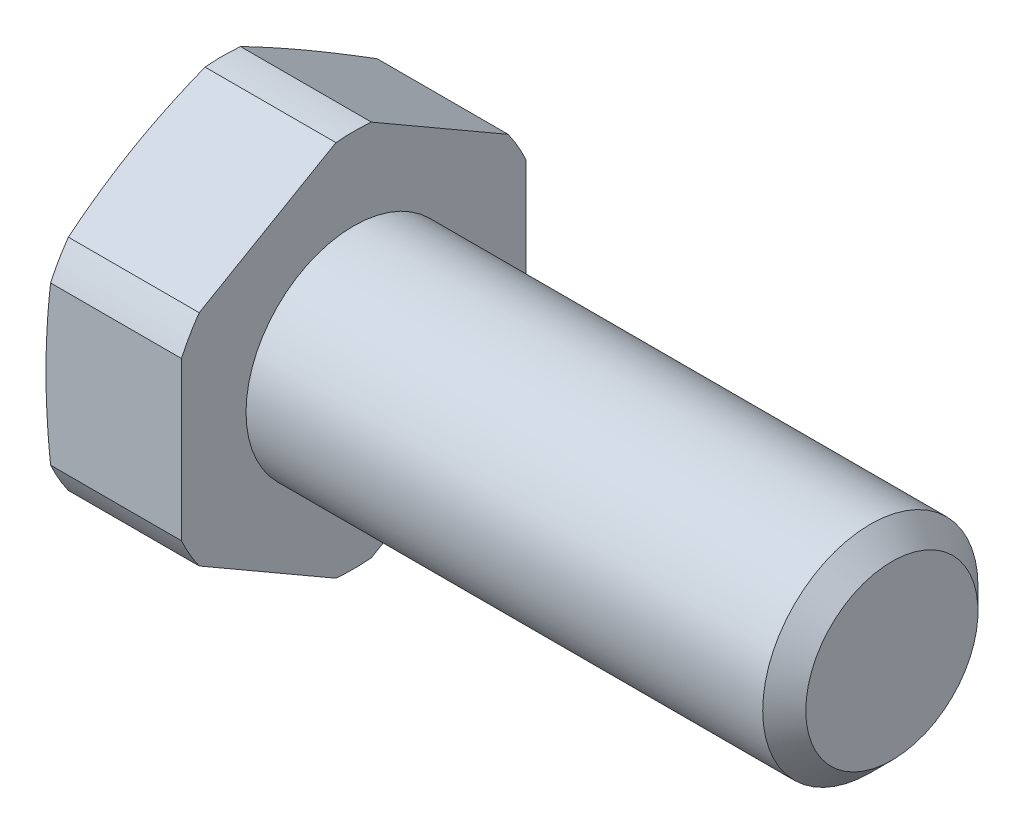
ISO-10303-21;
HEADER;
FILE_DESCRIPTION(('STEP AP214'),'2;1');
FILE_NAME('part.step','',(''),(''),'','','');
FILE_SCHEMA(('AUTOMOTIVE_DESIGN { 1 0 10303 214 1 1 1 1 }'));
ENDSEC;
DATA;
#1=APPLICATION_CONTEXT('core data for automotive mechanical design processes');
#2=APPLICATION_PROTOCOL_DEFINITION('international standard','automotive_design',2000,#1);
#3=PRODUCT_CONTEXT('',#1,'mechanical');
#4=PRODUCT('Part','Part','',(#3));
#5=PRODUCT_RELATED_PRODUCT_CATEGORY('part','',(#4));
#6=PRODUCT_DEFINITION_FORMATION('','',#4);
#7=PRODUCT_DEFINITION_CONTEXT('part definition',#1,'design');
#8=PRODUCT_DEFINITION('design','',#6,#7);
#9=PRODUCT_DEFINITION_SHAPE('','',#8);
#10=(LENGTH_UNIT() NAMED_UNIT(*) SI_UNIT(.MILLI.,.METRE.));
#11=(NAMED_UNIT(*) PLANE_ANGLE_UNIT() SI_UNIT($,.RADIAN.));
#12=(NAMED_UNIT(*) SI_UNIT($,.STERADIAN.) SOLID_ANGLE_UNIT());
#13=UNCERTAINTY_MEASURE_WITH_UNIT(LENGTH_MEASURE(1.E-05),#10,'distance_accuracy_value','');
#14=(GEOMETRIC_REPRESENTATION_CONTEXT(3) GLOBAL_UNCERTAINTY_ASSIGNED_CONTEXT((#13)) GLOBAL_UNIT_ASSIGNED_CONTEXT((#10,
#11,#12)) REPRESENTATION_CONTEXT('',''));
#15=CARTESIAN_POINT('',(0.,0.,0.));
#16=DIRECTION('',(0.,0.,1.));
#17=DIRECTION('',(1.,0.,0.));
#18=AXIS2_PLACEMENT_3D('',#15,#16,#17);
#19=CARTESIAN_POINT('',(-6.0784609690826,0.,0.));
#20=DIRECTION('',(1.,0.,0.));
#21=DIRECTION('',(0.,0.,-1.));
#22=AXIS2_PLACEMENT_3D('',#19,#20,#21);
#23=CONICAL_SURFACE('',#22,8.8,1.30899693899574);
#24=CARTESIAN_POINT('',(-6.39999999999996,0.,0.));
#25=DIRECTION('',(-1.,0.,0.));
#26=DIRECTION('',(0.,0.,1.));
#27=AXIS2_PLACEMENT_3D('',#24,#25,#26);
#28=CIRCLE('',#27,7.6);
#29=CARTESIAN_POINT('',(-6.39999999999996,0.,7.6));
#30=VERTEX_POINT('',#29);
#31=EDGE_CURVE('E134',#30,#30,#28,.T.);
#32=ORIENTED_EDGE('',*,*,#31,.F.);
#33=EDGE_LOOP('',(#32));
#34=FACE_BOUND('',#33,.T.);
#35=CARTESIAN_POINT('',(-6.0782609690826,5.09427729284164,-7.17645290095384));
#36=CARTESIAN_POINT('',(-6.11233521411133,5.24673459580645,-6.91238910623386));
#37=CARTESIAN_POINT('',(-6.14290411475749,5.399399818097,-6.64796518467785));
#38=CARTESIAN_POINT('',(-6.19617899279855,5.70509856387139,-6.11847942518651));
#39=CARTESIAN_POINT('',(-6.2188835631996,5.85813214833189,-5.85341748163655));
#40=CARTESIAN_POINT('',(-6.25550198129953,6.16394133316771,-5.32374043607968));
#41=CARTESIAN_POINT('',(-6.26944564691263,6.31671602415169,-5.0591269091848));
#42=CARTESIAN_POINT('',(-6.28810442863028,6.62239489485478,-4.52967557432677));
#43=CARTESIAN_POINT('',(-6.29282032302751,6.77529906256514,-4.26483778716339));
#44=CARTESIAN_POINT('',(-6.29282032302751,7.08110739798587,-3.73516221283661));
#45=CARTESIAN_POINT('',(-6.28810442863028,7.23401156569624,-3.47032442567323));
#46=CARTESIAN_POINT('',(-6.26944564691263,7.53969043639933,-2.9408730908152));
#47=CARTESIAN_POINT('',(-6.25550198129953,7.6924651273833,-2.67625956392032));
#48=CARTESIAN_POINT('',(-6.2188835631996,7.99827431221913,-2.14658251836345));
#49=CARTESIAN_POINT('',(-6.19617899279855,8.15130789667962,-1.88152057481348));
#50=CARTESIAN_POINT('',(-6.14290411475749,8.45700664245402,-1.35203481532215));
#51=CARTESIAN_POINT('',(-6.11233521411133,8.60967186474456,-1.08761089376613));
#52=CARTESIAN_POINT('',(-6.0782609690826,8.76212916770938,-0.823547099046155));
#53=B_SPLINE_CURVE_WITH_KNOTS('',3,(#35,#36,#37,#38,#39,#40,#41,#42,#43,#44,#45,#46,#47,#48,#49,
#50,#51,#52),.UNSPECIFIED.,.F.,.F.,(4,2,2,2,2,2,2,2,4),(0.,0.920453521143197,1.8410716340946,
2.75853918572606,3.67592935257665,4.59331951942724,5.51078707105871,6.43140518401011,
7.3518587051533),.UNSPECIFIED.);
#54=CARTESIAN_POINT('',(-6.0784609690826,5.09517295229317,-7.17490157327751));
#55=VERTEX_POINT('',#54);
#56=CARTESIAN_POINT('',(-6.0784609690826,8.76123350825785,-0.825098426722484));
#57=VERTEX_POINT('',#56);
#58=EDGE_CURVE('E206',#55,#57,#53,.T.);
#59=ORIENTED_EDGE('',*,*,#58,.F.);
#60=CARTESIAN_POINT('',(-6.0784609690826,0.,0.));
#61=DIRECTION('',(-1.,0.,0.));
#62=DIRECTION('',(0.,0.,1.));
#63=AXIS2_PLACEMENT_3D('',#60,#61,#62);
#64=CIRCLE('',#63,8.8);
#65=CARTESIAN_POINT('',(-6.0784609690826,3.66606055596466,-8.));
#66=VERTEX_POINT('',#65);
#67=EDGE_CURVE('E289',#55,#66,#64,.T.);
#68=ORIENTED_EDGE('',*,*,#67,.T.);
#69=CARTESIAN_POINT('',(-4.52835059955403,-12.1952806222728,-8.));
#70=CARTESIAN_POINT('',(-4.60958470236088,-11.8326033333338,-8.));
#71=CARTESIAN_POINT('',(-4.68982141688114,-11.46969855698,-8.));
#72=CARTESIAN_POINT('',(-4.84776173324878,-10.7433223565958,-8.));
#73=CARTESIAN_POINT('',(-4.9254652249717,-10.3798509086489,-8.));
#74=CARTESIAN_POINT('',(-5.07786901492262,-9.65190100818122,-8.));
#75=CARTESIAN_POINT('',(-5.15256626382136,-9.28742191496337,-8.));
#76=CARTESIAN_POINT('',(-5.29814759532216,-8.55770340441388,-8.));
#77=CARTESIAN_POINT('',(-5.3690317103539,-8.19246399357599,-8.));
#78=CARTESIAN_POINT('',(-5.50553069511125,-7.46401807454707,-8.));
#79=CARTESIAN_POINT('',(-5.57118314360988,-7.10081864291515,-8.));
#80=CARTESIAN_POINT('',(-5.6967308114908,-6.37342780848811,-8.));
#81=CARTESIAN_POINT('',(-5.75662615817,-6.00923642780944,-8.));
#82=CARTESIAN_POINT('',(-5.86930616766461,-5.27979364181287,-8.));
#83=CARTESIAN_POINT('',(-5.92209174386663,-4.91454237882789,-8.));
#84=CARTESIAN_POINT('',(-6.0189925088353,-4.18287833840633,-8.));
#85=CARTESIAN_POINT('',(-6.06310769045196,-3.81646556001218,-8.));
#86=CARTESIAN_POINT('',(-6.14141359964569,-3.07835342212742,-8.));
#87=CARTESIAN_POINT('',(-6.17548585135962,-2.70664130390878,-8.));
#88=CARTESIAN_POINT('',(-6.23135223506376,-1.9622876095219,-8.));
#89=CARTESIAN_POINT('',(-6.25314664862051,-1.58964605486521,-8.));
#90=CARTESIAN_POINT('',(-6.28318597760241,-0.843973611050866,-8.));
#91=CARTESIAN_POINT('',(-6.29143697245586,-0.470942971834518,-8.));
#92=CARTESIAN_POINT('',(-6.29388274135278,0.275165115690356,-8.));
#93=CARTESIAN_POINT('',(-6.28807752328639,0.648242563972488,-8.));
#94=CARTESIAN_POINT('',(-6.26273725237305,1.39528294126702,-8.));
#95=CARTESIAN_POINT('',(-6.24315222759362,1.76924414062937,-8.));
#96=CARTESIAN_POINT('',(-6.19136785961942,2.51628401775823,-8.));
#97=CARTESIAN_POINT('',(-6.15916823884374,2.88936267592291,-8.));
#98=CARTESIAN_POINT('',(-6.08377541477177,3.63463520576833,-8.));
#99=CARTESIAN_POINT('',(-6.04057508158152,4.00682834500358,-8.));
#100=CARTESIAN_POINT('',(-5.94497137211468,4.75001766769668,-8.));
#101=CARTESIAN_POINT('',(-5.89256796764405,5.12101384748405,-8.));
#102=CARTESIAN_POINT('',(-5.78397365663463,5.83714528307831,-8.));
#103=CARTESIAN_POINT('',(-5.72826851050407,6.18235494781391,-8.));
#104=CARTESIAN_POINT('',(-5.61147201858014,6.87186631823782,-8.));
#105=CARTESIAN_POINT('',(-5.55038052686073,7.21616799906675,-8.));
#106=CARTESIAN_POINT('',(-5.42379570867436,7.90398902108615,-8.));
#107=CARTESIAN_POINT('',(-5.35830199049421,8.24750828983782,-8.));
#108=CARTESIAN_POINT('',(-5.22371537149322,8.93384275624537,-8.));
#109=CARTESIAN_POINT('',(-5.15462242430965,9.27665794477265,-8.00000000000001));
#110=CARTESIAN_POINT('',(-4.94292152469712,10.3043485961511,-8.00000000000001));
#111=CARTESIAN_POINT('',(-4.795919954637,10.9883180570553,-8.00000000000001));
#112=CARTESIAN_POINT('',(-4.49397211631069,12.3544410800915,-8.00000000000001));
#113=CARTESIAN_POINT('',(-4.33902630949738,13.0365947452808,-8.00000000000001));
#114=CARTESIAN_POINT('',(-4.02509382219678,14.3928699320809,-8.00000000000001));
#115=CARTESIAN_POINT('',(-3.86616218288568,15.0670042290757,-8.00000000000001));
#116=CARTESIAN_POINT('',(-3.54432293159289,16.4143330535299,-8.00000000000001));
#117=CARTESIAN_POINT('',(-3.38141524765186,17.0875275637472,-8.00000000000001));
#118=CARTESIAN_POINT('',(-3.05286268631024,18.4323723404262,-8.00000000000001));
#119=CARTESIAN_POINT('',(-2.88722140944746,19.1040234882725,-8.00000000000001));
#120=CARTESIAN_POINT('',(-2.55367729021011,20.446740971391,-8.00000000000001));
#121=CARTESIAN_POINT('',(-2.38577452229956,21.1178073251478,-8.00000000000001));
#122=CARTESIAN_POINT('',(-2.21707050864597,21.7886697356131,-8.00000000000001));
#123=B_SPLINE_CURVE_WITH_KNOTS('',3,(#69,#70,#71,#72,#73,#74,#75,#76,#77,#78,#79,#80,#81,#82,
#83,#84,#85,#86,#87,#88,#89,#90,#91,#92,#93,#94,#95,#96,#97,#98,#99,#100,#101,#102,#103,#104,
#105,#106,#107,#108,#109,#110,#111,#112,#113,#114,#115,#116,#117,#118,#119,#120,#121,#122),
.UNSPECIFIED.,.F.,.F.,(4,2,2,2,2,2,2,2,2,2,2,2,2,2,2,2,2,2,2,2,2,2,2,2,2,2,4),(0.,
1.11499522189125,2.23003885048758,3.34618637599188,4.46232440746178,5.56954375348562,
6.67673861183587,7.78379109379085,8.8908444886655,10.0104781658887,11.1300861656101,
12.2491914532776,13.3682961127607,14.4914802204804,15.6146890449647,16.7386277161875,
17.862569830709,18.9115453150517,19.960549226813,21.0096466035599,22.0587574973817,
24.1574404378019,26.2560016108909,28.3338312444812,30.4116985110193,32.4870183944342,
34.5622701101328),.UNSPECIFIED.);
#124=CARTESIAN_POINT('',(-6.0784609690826,-3.66606055596466,-8.));
#125=VERTEX_POINT('',#124);
#126=EDGE_CURVE('E185',#125,#66,#123,.T.);
#127=ORIENTED_EDGE('',*,*,#126,.F.);
#128=CARTESIAN_POINT('',(-6.0784609690826,-5.09517295229318,-7.1749015732775));
#129=VERTEX_POINT('',#128);
#130=EDGE_CURVE('E184',#125,#129,#64,.T.);
#131=ORIENTED_EDGE('',*,*,#130,.T.);
#132=CARTESIAN_POINT('',(-6.0782609690826,-8.76212916770938,-0.823547099046168));
#133=CARTESIAN_POINT('',(-6.11233521411133,-8.60967186474456,-1.08761089376615));
#134=CARTESIAN_POINT('',(-6.14290411475749,-8.45700664245402,-1.35203481532216));
#135=CARTESIAN_POINT('',(-6.19617899279855,-8.15130789667963,-1.88152057481349));
#136=CARTESIAN_POINT('',(-6.2188835631996,-7.99827431221913,-2.14658251836346));
#137=CARTESIAN_POINT('',(-6.25550198129953,-7.69246512738331,-2.67625956392032));
#138=CARTESIAN_POINT('',(-6.26944564691263,-7.53969043639933,-2.94087309081521));
#139=CARTESIAN_POINT('',(-6.28810442863028,-7.23401156569625,-3.47032442567323));
#140=CARTESIAN_POINT('',(-6.29282032302751,-7.08110739798588,-3.73516221283662));
#141=CARTESIAN_POINT('',(-6.29282032302751,-6.77529906256515,-4.26483778716339));
#142=CARTESIAN_POINT('',(-6.28810442863028,-6.62239489485478,-4.52967557432677));
#143=CARTESIAN_POINT('',(-6.26944564691263,-6.3167160241517,-5.0591269091848));
#144=CARTESIAN_POINT('',(-6.25550198129953,-6.16394133316772,-5.32374043607968));
#145=CARTESIAN_POINT('',(-6.2188835631996,-5.8581321483319,-5.85341748163654));
#146=CARTESIAN_POINT('',(-6.19617899279855,-5.7050985638714,-6.11847942518651));
#147=CARTESIAN_POINT('',(-6.14290411475749,-5.39939981809701,-6.64796518467784));
#148=CARTESIAN_POINT('',(-6.11233521411133,-5.24673459580646,-6.91238910623386));
#149=CARTESIAN_POINT('',(-6.0782609690826,-5.09427729284165,-7.17645290095383));
#150=B_SPLINE_CURVE_WITH_KNOTS('',3,(#132,#133,#134,#135,#136,#137,#138,#139,#140,#141,#142,
#143,#144,#145,#146,#147,#148,#149),.UNSPECIFIED.,.F.,.F.,(4,2,2,2,2,2,2,2,4),(0.,
0.920453521143194,1.84107163409459,2.75853918572605,3.67592935257664,4.59331951942723,
5.51078707105869,6.43140518401009,7.35185870515328),.UNSPECIFIED.);
#151=CARTESIAN_POINT('',(-6.0784609690826,-8.76123350825784,-0.825098426722498));
#152=VERTEX_POINT('',#151);
#153=EDGE_CURVE('E271',#152,#129,#150,.T.);
#154=ORIENTED_EDGE('',*,*,#153,.F.);
#155=CARTESIAN_POINT('',(-6.0784609690826,-8.76123350825784,0.825098426722503));
#156=VERTEX_POINT('',#155);
#157=EDGE_CURVE('E291',#152,#156,#64,.T.);
#158=ORIENTED_EDGE('',*,*,#157,.T.);
#159=CARTESIAN_POINT('',(-6.0782609690826,-5.09427729284165,7.17645290095383));
#160=CARTESIAN_POINT('',(-6.11233521411133,-5.24673459580647,6.91238910623386));
#161=CARTESIAN_POINT('',(-6.14290411475749,-5.39939981809701,6.64796518467784));
#162=CARTESIAN_POINT('',(-6.19617899279855,-5.7050985638714,6.11847942518651));
#163=CARTESIAN_POINT('',(-6.2188835631996,-5.8581321483319,5.85341748163654));
#164=CARTESIAN_POINT('',(-6.25550198129953,-6.16394133316772,5.32374043607968));
#165=CARTESIAN_POINT('',(-6.26944564691263,-6.3167160241517,5.0591269091848));
#166=CARTESIAN_POINT('',(-6.28810442863028,-6.62239489485478,4.52967557432677));
#167=CARTESIAN_POINT('',(-6.29282032302751,-6.77529906256515,4.26483778716339));
#168=CARTESIAN_POINT('',(-6.29282032302751,-7.08110739798588,3.73516221283662));
#169=CARTESIAN_POINT('',(-6.28810442863028,-7.23401156569624,3.47032442567323));
#170=CARTESIAN_POINT('',(-6.26944564691263,-7.53969043639933,2.94087309081521));
#171=CARTESIAN_POINT('',(-6.25550198129953,-7.69246512738331,2.67625956392033));
#172=CARTESIAN_POINT('',(-6.2188835631996,-7.99827431221913,2.14658251836346));
#173=CARTESIAN_POINT('',(-6.19617899279855,-8.15130789667962,1.8815205748135));
#174=CARTESIAN_POINT('',(-6.14290411475749,-8.45700664245402,1.35203481532217));
#175=CARTESIAN_POINT('',(-6.11233521411133,-8.60967186474456,1.08761089376615));
#176=CARTESIAN_POINT('',(-6.0782609690826,-8.76212916770938,0.823547099046172));
#177=B_SPLINE_CURVE_WITH_KNOTS('',3,(#159,#160,#161,#162,#163,#164,#165,#166,#167,#168,#169,
#170,#171,#172,#173,#174,#175,#176),.UNSPECIFIED.,.F.,.F.,(4,2,2,2,2,2,2,2,4),(0.,
0.920453521143194,1.84107163409459,2.75853918572605,3.67592935257664,4.59331951942722,
5.51078707105868,6.43140518401008,7.35185870515328),.UNSPECIFIED.);
#178=CARTESIAN_POINT('',(-6.0784609690826,-5.09517295229318,7.1749015732775));
#179=VERTEX_POINT('',#178);
#180=EDGE_CURVE('E260',#179,#156,#177,.T.);
#181=ORIENTED_EDGE('',*,*,#180,.F.);
#182=CARTESIAN_POINT('',(-6.0784609690826,-3.66606055596468,8.));
#183=VERTEX_POINT('',#182);
#184=EDGE_CURVE('E152',#179,#183,#64,.T.);
#185=ORIENTED_EDGE('',*,*,#184,.T.);
#186=CARTESIAN_POINT('',(-4.52835059955403,-12.1952806222728,8.));
#187=CARTESIAN_POINT('',(-4.60958470236089,-11.8326033333338,8.));
#188=CARTESIAN_POINT('',(-4.68982141688114,-11.46969855698,8.));
#189=CARTESIAN_POINT('',(-4.84776173324878,-10.7433223565958,8.));
#190=CARTESIAN_POINT('',(-4.9254652249717,-10.3798509086489,8.));
#191=CARTESIAN_POINT('',(-5.07786901492262,-9.65190100818122,8.));
#192=CARTESIAN_POINT('',(-5.15256626382135,-9.28742191496337,8.));
#193=CARTESIAN_POINT('',(-5.29814759532216,-8.55770340441388,8.));
#194=CARTESIAN_POINT('',(-5.3690317103539,-8.19246399357599,8.));
#195=CARTESIAN_POINT('',(-5.50553069511125,-7.46401807454708,8.));
#196=CARTESIAN_POINT('',(-5.57118314360988,-7.10081864291516,8.));
#197=CARTESIAN_POINT('',(-5.6967308114908,-6.37342780848811,8.));
#198=CARTESIAN_POINT('',(-5.75662615817,-6.00923642780944,8.));
#199=CARTESIAN_POINT('',(-5.86930616766461,-5.27979364181287,8.));
#200=CARTESIAN_POINT('',(-5.92209174386663,-4.91454237882789,8.));
#201=CARTESIAN_POINT('',(-6.0189925088353,-4.18287833840634,8.));
#202=CARTESIAN_POINT('',(-6.06310769045196,-3.81646556001218,8.));
#203=CARTESIAN_POINT('',(-6.14141359964569,-3.07835342212742,8.));
#204=CARTESIAN_POINT('',(-6.17548585135962,-2.70664130390878,8.));
#205=CARTESIAN_POINT('',(-6.23135223506376,-1.9622876095219,8.));
#206=CARTESIAN_POINT('',(-6.25314664862051,-1.58964605486522,8.));
#207=CARTESIAN_POINT('',(-6.28318597760241,-0.843973611050865,8.));
#208=CARTESIAN_POINT('',(-6.29143697245586,-0.470942971834517,8.));
#209=CARTESIAN_POINT('',(-6.29388274135278,0.275165115690358,8.));
#210=CARTESIAN_POINT('',(-6.28807752328639,0.648242563972491,8.));
#211=CARTESIAN_POINT('',(-6.26273725237305,1.39528294126702,8.));
#212=CARTESIAN_POINT('',(-6.24315222759362,1.76924414062936,8.));
#213=CARTESIAN_POINT('',(-6.19136785961943,2.51628401775823,8.));
#214=CARTESIAN_POINT('',(-6.15916823884374,2.88936267592291,8.));
#215=CARTESIAN_POINT('',(-6.08377541477177,3.63463520576833,8.));
#216=CARTESIAN_POINT('',(-6.04057508158152,4.00682834500357,8.));
#217=CARTESIAN_POINT('',(-5.94497137211468,4.75001766769668,8.));
#218=CARTESIAN_POINT('',(-5.89256796764406,5.12101384748405,8.));
#219=CARTESIAN_POINT('',(-5.78397365663464,5.83714528307831,8.));
#220=CARTESIAN_POINT('',(-5.72826851050407,6.18235494781391,8.));
#221=CARTESIAN_POINT('',(-5.61147201858014,6.87186631823781,8.));
#222=CARTESIAN_POINT('',(-5.55038052686074,7.21616799906675,8.));
#223=CARTESIAN_POINT('',(-5.42379570867437,7.90398902108614,8.));
#224=CARTESIAN_POINT('',(-5.35830199049421,8.24750828983781,8.));
#225=CARTESIAN_POINT('',(-5.22371537149322,8.93384275624536,8.));
#226=CARTESIAN_POINT('',(-5.15462242430966,9.27665794477264,7.99999999999999));
#227=CARTESIAN_POINT('',(-4.94292152469712,10.3043485961511,7.99999999999999));
#228=CARTESIAN_POINT('',(-4.795919954637,10.9883180570553,7.99999999999999));
#229=CARTESIAN_POINT('',(-4.4939721163107,12.3544410800914,7.99999999999999));
#230=CARTESIAN_POINT('',(-4.33902630949739,13.0365947452808,7.99999999999999));
#231=CARTESIAN_POINT('',(-4.02509382219679,14.3928699320809,7.99999999999999));
#232=CARTESIAN_POINT('',(-3.86616218288568,15.0670042290757,7.99999999999999));
#233=CARTESIAN_POINT('',(-3.54432293159289,16.4143330535299,7.99999999999999));
#234=CARTESIAN_POINT('',(-3.38141524765186,17.0875275637472,7.99999999999999));
#235=CARTESIAN_POINT('',(-3.05286268631024,18.4323723404262,7.99999999999999));
#236=CARTESIAN_POINT('',(-2.88722140944746,19.1040234882725,7.99999999999999));
#237=CARTESIAN_POINT('',(-2.55367729021011,20.446740971391,7.99999999999999));
#238=CARTESIAN_POINT('',(-2.38577452229956,21.1178073251478,7.99999999999999));
#239=CARTESIAN_POINT('',(-2.21707050864597,21.7886697356131,7.99999999999999));
#240=B_SPLINE_CURVE_WITH_KNOTS('',3,(#186,#187,#188,#189,#190,#191,#192,#193,#194,#195,#196,
#197,#198,#199,#200,#201,#202,#203,#204,#205,#206,#207,#208,#209,#210,#211,#212,#213,#214,#215,
#216,#217,#218,#219,#220,#221,#222,#223,#224,#225,#226,#227,#228,#229,#230,#231,#232,#233,#234,
#235,#236,#237,#238,#239),.UNSPECIFIED.,.F.,.F.,(4,2,2,2,2,2,2,2,2,2,2,2,2,2,2,2,2,2,2,2,2,2,2,
2,2,2,4),(0.,1.11499522189125,2.23003885048758,3.34618637599187,4.46232440746178,
5.56954375348561,6.67673861183587,7.78379109379085,8.89084448866549,10.0104781658886,
11.1300861656101,12.2491914532776,13.3682961127607,14.4914802204804,15.6146890449647,
16.7386277161875,17.862569830709,18.9115453150517,19.960549226813,21.0096466035599,
22.0587574973817,24.1574404378018,26.2560016108909,28.3338312444812,30.4116985110193,
32.4870183944342,34.5622701101328),.UNSPECIFIED.);
#241=CARTESIAN_POINT('',(-6.0784609690826,3.66606055596468,8.));
#242=VERTEX_POINT('',#241);
#243=EDGE_CURVE('E243',#242,#183,#240,.F.);
#244=ORIENTED_EDGE('',*,*,#243,.F.);
#245=CARTESIAN_POINT('',(-6.0784609690826,5.09517295229318,7.17490157327751));
#246=VERTEX_POINT('',#245);
#247=EDGE_CURVE('E160',#242,#246,#64,.T.);
#248=ORIENTED_EDGE('',*,*,#247,.T.);
#249=CARTESIAN_POINT('',(-6.0782609690826,8.76212916770938,0.823547099046155));
#250=CARTESIAN_POINT('',(-6.11233521411133,8.60967186474456,1.08761089376613));
#251=CARTESIAN_POINT('',(-6.14290411475749,8.45700664245402,1.35203481532215));
#252=CARTESIAN_POINT('',(-6.19617899279855,8.15130789667963,1.88152057481348));
#253=CARTESIAN_POINT('',(-6.2188835631996,7.99827431221913,2.14658251836345));
#254=CARTESIAN_POINT('',(-6.25550198129953,7.69246512738331,2.67625956392032));
#255=CARTESIAN_POINT('',(-6.26944564691263,7.53969043639933,2.9408730908152));
#256=CARTESIAN_POINT('',(-6.28810442863028,7.23401156569624,3.47032442567322));
#257=CARTESIAN_POINT('',(-6.29282032302751,7.08110739798588,3.73516221283661));
#258=CARTESIAN_POINT('',(-6.29282032302751,6.77529906256515,4.26483778716338));
#259=CARTESIAN_POINT('',(-6.28810442863028,6.62239489485478,4.52967557432677));
#260=CARTESIAN_POINT('',(-6.26944564691263,6.31671602415169,5.05912690918479));
#261=CARTESIAN_POINT('',(-6.25550198129953,6.16394133316772,5.32374043607967));
#262=CARTESIAN_POINT('',(-6.2188835631996,5.8581321483319,5.85341748163654));
#263=CARTESIAN_POINT('',(-6.19617899279855,5.7050985638714,6.11847942518651));
#264=CARTESIAN_POINT('',(-6.14290411475749,5.39939981809701,6.64796518467784));
#265=CARTESIAN_POINT('',(-6.11233521411133,5.24673459580646,6.91238910623386));
#266=CARTESIAN_POINT('',(-6.0782609690826,5.09427729284165,7.17645290095383));
#267=B_SPLINE_CURVE_WITH_KNOTS('',3,(#249,#250,#251,#252,#253,#254,#255,#256,#257,#258,#259,
#260,#261,#262,#263,#264,#265,#266),.UNSPECIFIED.,.F.,.F.,(4,2,2,2,2,2,2,2,4),(0.,
0.920453521143196,1.84107163409459,2.75853918572606,3.67592935257665,4.59331951942723,
5.5107870710587,6.4314051840101,7.35185870515329),.UNSPECIFIED.);
#268=CARTESIAN_POINT('',(-6.0784609690826,8.76123350825785,0.825098426722485));
#269=VERTEX_POINT('',#268);
#270=EDGE_CURVE('E144',#269,#246,#267,.T.);
#271=ORIENTED_EDGE('',*,*,#270,.F.);
#272=EDGE_CURVE('E143',#269,#57,#64,.T.);
#273=ORIENTED_EDGE('',*,*,#272,.T.);
#274=EDGE_LOOP('',(#59,#68,#127,#131,#154,#158,#181,#185,#244,#248,#271,#273));
#275=FACE_BOUND('',#274,.T.);
#276=ADVANCED_FACE('F35',(#34,#275),#23,.T.);
#277=CARTESIAN_POINT('',(-1000.,0.,0.));
#278=DIRECTION('',(-1.,0.,0.));
#279=DIRECTION('',(0.,0.,1.));
#280=AXIS2_PLACEMENT_3D('',#277,#278,#279);
#281=CYLINDRICAL_SURFACE('',#280,8.8);
#282=DIRECTION('',(-1.,0.,0.));
#283=VECTOR('',#282,1.);
#284=CARTESIAN_POINT('',(-1000.,5.09517295229317,-7.17490157327751));
#285=LINE('',#284,#283);
#286=CARTESIAN_POINT('',(0.,5.09517295229317,-7.17490157327751));
#287=VERTEX_POINT('',#286);
#288=EDGE_CURVE('E215',#287,#55,#285,.T.);
#289=ORIENTED_EDGE('',*,*,#288,.F.);
#290=CARTESIAN_POINT('',(0.,0.,0.));
#291=DIRECTION('',(-1.,0.,0.));
#292=DIRECTION('',(0.,0.,1.));
#293=AXIS2_PLACEMENT_3D('',#290,#291,#292);
#294=CIRCLE('',#293,8.8);
#295=CARTESIAN_POINT('',(0.,3.66606055596467,-8.));
#296=VERTEX_POINT('',#295);
#297=EDGE_CURVE('E150',#287,#296,#294,.T.);
#298=ORIENTED_EDGE('',*,*,#297,.T.);
#299=DIRECTION('',(-1.,0.,0.));
#300=VECTOR('',#299,1.);
#301=CARTESIAN_POINT('',(-1000.,3.66606055596466,-8.));
#302=LINE('',#301,#300);
#303=EDGE_CURVE('E176',#66,#296,#302,.F.);
#304=ORIENTED_EDGE('',*,*,#303,.F.);
#305=ORIENTED_EDGE('',*,*,#67,.F.);
#306=EDGE_LOOP('',(#289,#298,#304,#305));
#307=FACE_BOUND('',#306,.T.);
#308=ADVANCED_FACE('F290',(#307),#281,.T.);
#309=DIRECTION('',(-1.,0.,0.));
#310=VECTOR('',#309,1.);
#311=CARTESIAN_POINT('',(-1000.,8.76123350825785,-0.825098426722484));
#312=LINE('',#311,#310);
#313=CARTESIAN_POINT('',(0.,8.76123350825785,-0.825098426722488));
#314=VERTEX_POINT('',#313);
#315=EDGE_CURVE('E282',#57,#314,#312,.F.);
#316=ORIENTED_EDGE('',*,*,#315,.F.);
#317=ORIENTED_EDGE('',*,*,#272,.F.);
#318=DIRECTION('',(-1.,0.,0.));
#319=VECTOR('',#318,1.);
#320=CARTESIAN_POINT('',(-1000.,8.76123350825785,0.825098426722485));
#321=LINE('',#320,#319);
#322=CARTESIAN_POINT('',(0.,8.76123350825785,0.825098426722489));
#323=VERTEX_POINT('',#322);
#324=EDGE_CURVE('E125',#323,#269,#321,.T.);
#325=ORIENTED_EDGE('',*,*,#324,.F.);
#326=EDGE_CURVE('E141',#323,#314,#294,.T.);
#327=ORIENTED_EDGE('',*,*,#326,.T.);
#328=EDGE_LOOP('',(#316,#317,#325,#327));
#329=FACE_BOUND('',#328,.T.);
#330=ADVANCED_FACE('F140',(#329),#281,.T.);
#331=DIRECTION('',(-1.,0.,0.));
#332=VECTOR('',#331,1.);
#333=CARTESIAN_POINT('',(-1000.,-3.66606055596466,-8.));
#334=LINE('',#333,#332);
#335=CARTESIAN_POINT('',(0.,-3.66606055596467,-8.));
#336=VERTEX_POINT('',#335);
#337=EDGE_CURVE('E173',#336,#125,#334,.T.);
#338=ORIENTED_EDGE('',*,*,#337,.F.);
#339=CARTESIAN_POINT('',(0.,-5.09517295229318,-7.1749015732775));
#340=VERTEX_POINT('',#339);
#341=EDGE_CURVE('E155',#336,#340,#294,.T.);
#342=ORIENTED_EDGE('',*,*,#341,.T.);
#343=DIRECTION('',(-1.,0.,0.));
#344=VECTOR('',#343,1.);
#345=CARTESIAN_POINT('',(-1000.,-5.09517295229318,-7.1749015732775));
#346=LINE('',#345,#344);
#347=EDGE_CURVE('E266',#129,#340,#346,.F.);
#348=ORIENTED_EDGE('',*,*,#347,.F.);
#349=ORIENTED_EDGE('',*,*,#130,.F.);
#350=EDGE_LOOP('',(#338,#342,#348,#349));
#351=FACE_BOUND('',#350,.T.);
#352=ADVANCED_FACE('F181',(#351),#281,.T.);
#353=DIRECTION('',(-1.,0.,0.));
#354=VECTOR('',#353,1.);
#355=CARTESIAN_POINT('',(-1000.,-8.76123350825784,-0.825098426722498));
#356=LINE('',#355,#354);
#357=CARTESIAN_POINT('',(0.,-8.76123350825785,-0.825098426722498));
#358=VERTEX_POINT('',#357);
#359=EDGE_CURVE('E269',#358,#152,#356,.T.);
#360=ORIENTED_EDGE('',*,*,#359,.F.);
#361=CARTESIAN_POINT('',(0.,-8.76123350825784,0.825098426722499));
#362=VERTEX_POINT('',#361);
#363=EDGE_CURVE('E189',#358,#362,#294,.T.);
#364=ORIENTED_EDGE('',*,*,#363,.T.);
#365=DIRECTION('',(-1.,0.,0.));
#366=VECTOR('',#365,1.);
#367=CARTESIAN_POINT('',(-1000.,-8.76123350825784,0.825098426722503));
#368=LINE('',#367,#366);
#369=EDGE_CURVE('E58',#156,#362,#368,.F.);
#370=ORIENTED_EDGE('',*,*,#369,.F.);
#371=ORIENTED_EDGE('',*,*,#157,.F.);
#372=EDGE_LOOP('',(#360,#364,#370,#371));
#373=FACE_BOUND('',#372,.T.);
#374=ADVANCED_FACE('F310',(#373),#281,.T.);
#375=DIRECTION('',(-1.,0.,0.));
#376=VECTOR('',#375,1.);
#377=CARTESIAN_POINT('',(-1000.,-5.09517295229318,7.1749015732775));
#378=LINE('',#377,#376);
#379=CARTESIAN_POINT('',(0.,-5.09517295229318,7.1749015732775));
#380=VERTEX_POINT('',#379);
#381=EDGE_CURVE('E267',#380,#179,#378,.T.);
#382=ORIENTED_EDGE('',*,*,#381,.F.);
#383=CARTESIAN_POINT('',(0.,-3.66606055596468,8.));
#384=VERTEX_POINT('',#383);
#385=EDGE_CURVE('E153',#380,#384,#294,.T.);
#386=ORIENTED_EDGE('',*,*,#385,.T.);
#387=DIRECTION('',(-1.,0.,0.));
#388=VECTOR('',#387,1.);
#389=CARTESIAN_POINT('',(-1000.,-3.66606055596468,8.));
#390=LINE('',#389,#388);
#391=EDGE_CURVE('E50',#183,#384,#390,.F.);
#392=ORIENTED_EDGE('',*,*,#391,.F.);
#393=ORIENTED_EDGE('',*,*,#184,.F.);
#394=EDGE_LOOP('',(#382,#386,#392,#393));
#395=FACE_BOUND('',#394,.T.);
#396=ADVANCED_FACE('F300',(#395),#281,.T.);
#397=DIRECTION('',(-1.,0.,0.));
#398=VECTOR('',#397,1.);
#399=CARTESIAN_POINT('',(-1000.,3.66606055596468,8.));
#400=LINE('',#399,#398);
#401=CARTESIAN_POINT('',(0.,3.66606055596468,8.));
#402=VERTEX_POINT('',#401);
#403=EDGE_CURVE('E241',#402,#242,#400,.T.);
#404=ORIENTED_EDGE('',*,*,#403,.F.);
#405=CARTESIAN_POINT('',(0.,5.09517295229318,7.17490157327751));
#406=VERTEX_POINT('',#405);
#407=EDGE_CURVE('E149',#402,#406,#294,.T.);
#408=ORIENTED_EDGE('',*,*,#407,.T.);
#409=DIRECTION('',(-1.,0.,0.));
#410=VECTOR('',#409,1.);
#411=CARTESIAN_POINT('',(-1000.,5.09517295229318,7.17490157327751));
#412=LINE('',#411,#410);
#413=EDGE_CURVE('E128',#246,#406,#412,.F.);
#414=ORIENTED_EDGE('',*,*,#413,.F.);
#415=ORIENTED_EDGE('',*,*,#247,.F.);
#416=EDGE_LOOP('',(#404,#408,#414,#415));
#417=FACE_BOUND('',#416,.T.);
#418=ADVANCED_FACE('F303',(#417),#281,.T.);
#419=CARTESIAN_POINT('',(0.,8.8,0.));
#420=DIRECTION('',(-1.,0.,0.));
#421=DIRECTION('',(0.,0.,1.));
#422=AXIS2_PLACEMENT_3D('',#419,#420,#421);
#423=PLANE('',#422);
#424=CARTESIAN_POINT('',(0.,0.,0.));
#425=DIRECTION('',(-1.,0.,0.));
#426=DIRECTION('',(0.,0.,1.));
#427=AXIS2_PLACEMENT_3D('',#424,#425,#426);
#428=CIRCLE('',#427,5.);
#429=CARTESIAN_POINT('',(0.,0.,5.));
#430=VERTEX_POINT('',#429);
#431=EDGE_CURVE('E158',#430,#430,#428,.T.);
#432=ORIENTED_EDGE('',*,*,#431,.T.);
#433=EDGE_LOOP('',(#432));
#434=FACE_BOUND('',#433,.T.);
#435=DIRECTION('',(0.,-0.5,-0.866025403784439));
#436=VECTOR('',#435,1.);
#437=CARTESIAN_POINT('',(0.,9.12820323027551,-0.189488223348468));
#438=LINE('',#437,#436);
#439=EDGE_CURVE('E12',#314,#287,#438,.T.);
#440=ORIENTED_EDGE('',*,*,#439,.F.);
#441=ORIENTED_EDGE('',*,*,#326,.F.);
#442=DIRECTION('',(0.,0.5,-0.866025403784439));
#443=VECTOR('',#442,1.);
#444=CARTESIAN_POINT('',(0.,9.12820323027551,0.189488223348468));
#445=LINE('',#444,#443);
#446=EDGE_CURVE('E122',#406,#323,#445,.T.);
#447=ORIENTED_EDGE('',*,*,#446,.F.);
#448=ORIENTED_EDGE('',*,*,#407,.F.);
#449=DIRECTION('',(0.,1.,0.));
#450=VECTOR('',#449,1.);
#451=CARTESIAN_POINT('',(0.,8.8,8.));
#452=LINE('',#451,#450);
#453=EDGE_CURVE('E133',#384,#402,#452,.T.);
#454=ORIENTED_EDGE('',*,*,#453,.F.);
#455=ORIENTED_EDGE('',*,*,#385,.F.);
#456=DIRECTION('',(0.,0.5,0.866025403784439));
#457=VECTOR('',#456,1.);
#458=CARTESIAN_POINT('',(0.,-4.72820323027551,7.81051177665153));
#459=LINE('',#458,#457);
#460=EDGE_CURVE('E166',#362,#380,#459,.T.);
#461=ORIENTED_EDGE('',*,*,#460,.F.);
#462=ORIENTED_EDGE('',*,*,#363,.F.);
#463=DIRECTION('',(0.,-0.5,0.866025403784439));
#464=VECTOR('',#463,1.);
#465=CARTESIAN_POINT('',(0.,-4.72820323027551,-7.81051177665153));
#466=LINE('',#465,#464);
#467=EDGE_CURVE('E168',#340,#358,#466,.T.);
#468=ORIENTED_EDGE('',*,*,#467,.F.);
#469=ORIENTED_EDGE('',*,*,#341,.F.);
#470=DIRECTION('',(0.,-1.,0.));
#471=VECTOR('',#470,1.);
#472=CARTESIAN_POINT('',(0.,8.8,-8.));
#473=LINE('',#472,#471);
#474=EDGE_CURVE('E43',#296,#336,#473,.T.);
#475=ORIENTED_EDGE('',*,*,#474,.F.);
#476=ORIENTED_EDGE('',*,*,#297,.F.);
#477=EDGE_LOOP('',(#440,#441,#447,#448,#454,#455,#461,#462,#468,#469,#475,#476));
#478=FACE_BOUND('',#477,.T.);
#479=ADVANCED_FACE('F147',(#434,#478),#423,.F.);
#480=CARTESIAN_POINT('',(-6.39999999999998,0.,0.));
#481=DIRECTION('',(1.,0.,0.));
#482=DIRECTION('',(0.,0.,-1.));
#483=AXIS2_PLACEMENT_3D('',#480,#481,#482);
#484=PLANE('',#483);
#485=ORIENTED_EDGE('',*,*,#31,.T.);
#486=EDGE_LOOP('',(#485));
#487=FACE_BOUND('',#486,.T.);
#488=ADVANCED_FACE('F37',(#487),#484,.F.);
#489=CARTESIAN_POINT('',(-1000.,0.,0.));
#490=DIRECTION('',(-1.,0.,0.));
#491=DIRECTION('',(0.,0.,1.));
#492=AXIS2_PLACEMENT_3D('',#489,#490,#491);
#493=CYLINDRICAL_SURFACE('',#492,5.);
#494=ORIENTED_EDGE('',*,*,#431,.F.);
#495=EDGE_LOOP('',(#494));
#496=FACE_BOUND('',#495,.T.);
#497=CARTESIAN_POINT('',(24.,0.,0.));
#498=DIRECTION('',(-1.,0.,0.));
#499=DIRECTION('',(0.,0.,1.));
#500=AXIS2_PLACEMENT_3D('',#497,#498,#499);
#501=CIRCLE('',#500,5.);
#502=CARTESIAN_POINT('',(24.,0.,5.));
#503=VERTEX_POINT('',#502);
#504=EDGE_CURVE('E198',#503,#503,#501,.T.);
#505=ORIENTED_EDGE('',*,*,#504,.T.);
#506=EDGE_LOOP('',(#505));
#507=FACE_BOUND('',#506,.T.);
#508=ADVANCED_FACE('F319',(#496,#507),#493,.T.);
#509=CARTESIAN_POINT('',(24.9999999999999,0.,0.));
#510=DIRECTION('',(-1.,0.,0.));
#511=DIRECTION('',(0.,0.,1.));
#512=AXIS2_PLACEMENT_3D('',#509,#510,#511);
#513=CONICAL_SURFACE('',#512,4.,0.785398163397503);
#514=ORIENTED_EDGE('',*,*,#504,.F.);
#515=EDGE_LOOP('',(#514));
#516=FACE_BOUND('',#515,.T.);
#517=CARTESIAN_POINT('',(24.9999999999999,0.,0.));
#518=DIRECTION('',(-1.,0.,0.));
#519=DIRECTION('',(0.,0.,1.));
#520=AXIS2_PLACEMENT_3D('',#517,#518,#519);
#521=CIRCLE('',#520,4.);
#522=CARTESIAN_POINT('',(24.9999999999999,0.,4.));
#523=VERTEX_POINT('',#522);
#524=EDGE_CURVE('E202',#523,#523,#521,.T.);
#525=ORIENTED_EDGE('',*,*,#524,.T.);
#526=EDGE_LOOP('',(#525));
#527=FACE_BOUND('',#526,.T.);
#528=ADVANCED_FACE('F323',(#516,#527),#513,.T.);
#529=CARTESIAN_POINT('',(25.,4.,0.));
#530=DIRECTION('',(-1.,0.,0.));
#531=DIRECTION('',(0.,0.,1.));
#532=AXIS2_PLACEMENT_3D('',#529,#530,#531);
#533=PLANE('',#532);
#534=ORIENTED_EDGE('',*,*,#524,.F.);
#535=EDGE_LOOP('',(#534));
#536=FACE_BOUND('',#535,.T.);
#537=ADVANCED_FACE('F231',(#536),#533,.F.);
#538=CARTESIAN_POINT('',(50.7716958955621,4.61880215351701,8.));
#539=DIRECTION('',(0.,0.866025403784439,0.499999999999999));
#540=DIRECTION('',(0.,-0.5,0.866025403784439));
#541=AXIS2_PLACEMENT_3D('',#538,#539,#540);
#542=PLANE('',#541);
#543=ORIENTED_EDGE('',*,*,#270,.T.);
#544=ORIENTED_EDGE('',*,*,#413,.T.);
#545=ORIENTED_EDGE('',*,*,#446,.T.);
#546=ORIENTED_EDGE('',*,*,#324,.T.);
#547=EDGE_LOOP('',(#543,#544,#545,#546));
#548=FACE_BOUND('',#547,.T.);
#549=ADVANCED_FACE('F124',(#548),#542,.T.);
#550=CARTESIAN_POINT('',(50.7716958955621,-4.61880215351701,8.));
#551=DIRECTION('',(0.,0.,1.));
#552=DIRECTION('',(0.,-1.,0.));
#553=AXIS2_PLACEMENT_3D('',#550,#551,#552);
#554=PLANE('',#553);
#555=ORIENTED_EDGE('',*,*,#243,.T.);
#556=ORIENTED_EDGE('',*,*,#391,.T.);
#557=ORIENTED_EDGE('',*,*,#453,.T.);
#558=ORIENTED_EDGE('',*,*,#403,.T.);
#559=EDGE_LOOP('',(#555,#556,#557,#558));
#560=FACE_BOUND('',#559,.T.);
#561=ADVANCED_FACE('F230',(#560),#554,.T.);
#562=CARTESIAN_POINT('',(50.7716958955621,-9.23760430703402,0.));
#563=DIRECTION('',(0.,-0.866025403784439,0.5));
#564=DIRECTION('',(0.,-0.5,-0.866025403784439));
#565=AXIS2_PLACEMENT_3D('',#562,#563,#564);
#566=PLANE('',#565);
#567=ORIENTED_EDGE('',*,*,#180,.T.);
#568=ORIENTED_EDGE('',*,*,#369,.T.);
#569=ORIENTED_EDGE('',*,*,#460,.T.);
#570=ORIENTED_EDGE('',*,*,#381,.T.);
#571=EDGE_LOOP('',(#567,#568,#569,#570));
#572=FACE_BOUND('',#571,.T.);
#573=ADVANCED_FACE('F254',(#572),#566,.T.);
#574=CARTESIAN_POINT('',(50.7716958955621,-4.61880215351701,-8.));
#575=DIRECTION('',(0.,-0.866025403784439,-0.5));
#576=DIRECTION('',(0.,0.5,-0.866025403784439));
#577=AXIS2_PLACEMENT_3D('',#574,#575,#576);
#578=PLANE('',#577);
#579=ORIENTED_EDGE('',*,*,#153,.T.);
#580=ORIENTED_EDGE('',*,*,#347,.T.);
#581=ORIENTED_EDGE('',*,*,#467,.T.);
#582=ORIENTED_EDGE('',*,*,#359,.T.);
#583=EDGE_LOOP('',(#579,#580,#581,#582));
#584=FACE_BOUND('',#583,.T.);
#585=ADVANCED_FACE('F257',(#584),#578,.T.);
#586=CARTESIAN_POINT('',(50.7716958955621,4.618802153517,-8.));
#587=DIRECTION('',(0.,0.,-1.));
#588=DIRECTION('',(0.,1.,0.));
#589=AXIS2_PLACEMENT_3D('',#586,#587,#588);
#590=PLANE('',#589);
#591=ORIENTED_EDGE('',*,*,#126,.T.);
#592=ORIENTED_EDGE('',*,*,#303,.T.);
#593=ORIENTED_EDGE('',*,*,#474,.T.);
#594=ORIENTED_EDGE('',*,*,#337,.T.);
#595=EDGE_LOOP('',(#591,#592,#593,#594));
#596=FACE_BOUND('',#595,.T.);
#597=ADVANCED_FACE('F172',(#596),#590,.T.);
#598=CARTESIAN_POINT('',(50.7716958955621,9.23760430703401,0.));
#599=DIRECTION('',(0.,0.866025403784439,-0.5));
#600=DIRECTION('',(0.,0.5,0.866025403784439));
#601=AXIS2_PLACEMENT_3D('',#598,#599,#600);
#602=PLANE('',#601);
#603=ORIENTED_EDGE('',*,*,#58,.T.);
#604=ORIENTED_EDGE('',*,*,#315,.T.);
#605=ORIENTED_EDGE('',*,*,#439,.T.);
#606=ORIENTED_EDGE('',*,*,#288,.T.);
#607=EDGE_LOOP('',(#603,#604,#605,#606));
#608=FACE_BOUND('',#607,.T.);
#609=ADVANCED_FACE('F219',(#608),#602,.T.);
#610=CLOSED_SHELL('',(#276,#308,#330,#352,#374,#396,#418,#479,#488,#508,#528,#537,#549,#561,
#573,#585,#597,#609));
#611=MANIFOLD_SOLID_BREP('B2',#610);
#612=ADVANCED_BREP_SHAPE_REPRESENTATION('',(#18,#611),#14);
#613=SHAPE_DEFINITION_REPRESENTATION(#9,#612);
ENDSEC;
END-ISO-10303-21;
